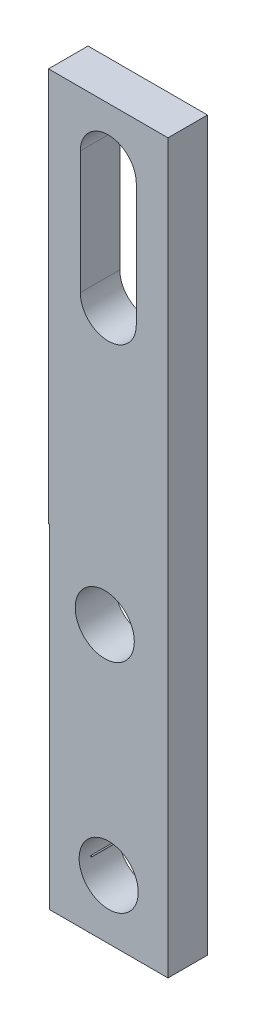
ISO-10303-21;
HEADER;
FILE_DESCRIPTION(('STEP AP214'),'2;1');
FILE_NAME('part.step','',(''),(''),'','','');
FILE_SCHEMA(('AUTOMOTIVE_DESIGN { 1 0 10303 214 1 1 1 1 }'));
ENDSEC;
DATA;
#1=APPLICATION_CONTEXT('core data for automotive mechanical design processes');
#2=APPLICATION_PROTOCOL_DEFINITION('international standard','automotive_design',2000,#1);
#3=PRODUCT_CONTEXT('',#1,'mechanical');
#4=PRODUCT('Part','Part','',(#3));
#5=PRODUCT_RELATED_PRODUCT_CATEGORY('part','',(#4));
#6=PRODUCT_DEFINITION_FORMATION('','',#4);
#7=PRODUCT_DEFINITION_CONTEXT('part definition',#1,'design');
#8=PRODUCT_DEFINITION('design','',#6,#7);
#9=PRODUCT_DEFINITION_SHAPE('','',#8);
#10=(LENGTH_UNIT() NAMED_UNIT(*) SI_UNIT(.MILLI.,.METRE.));
#11=(NAMED_UNIT(*) PLANE_ANGLE_UNIT() SI_UNIT($,.RADIAN.));
#12=(NAMED_UNIT(*) SI_UNIT($,.STERADIAN.) SOLID_ANGLE_UNIT());
#13=UNCERTAINTY_MEASURE_WITH_UNIT(LENGTH_MEASURE(1.E-05),#10,'distance_accuracy_value','');
#14=(GEOMETRIC_REPRESENTATION_CONTEXT(3) GLOBAL_UNCERTAINTY_ASSIGNED_CONTEXT((#13)) GLOBAL_UNIT_ASSIGNED_CONTEXT((#10,
#11,#12)) REPRESENTATION_CONTEXT('',''));
#15=CARTESIAN_POINT('',(0.,0.,0.));
#16=DIRECTION('',(0.,0.,1.));
#17=DIRECTION('',(1.,0.,0.));
#18=AXIS2_PLACEMENT_3D('',#15,#16,#17);
#19=CARTESIAN_POINT('',(0.,-102.917357181781,2.54));
#20=DIRECTION('',(0.,1.,0.));
#21=DIRECTION('',(0.,0.,1.));
#22=AXIS2_PLACEMENT_3D('',#19,#20,#21);
#23=PLANE('',#22);
#24=DIRECTION('',(1.,0.,0.));
#25=VECTOR('',#24,1.);
#26=CARTESIAN_POINT('',(0.,-102.917357181781,0.));
#27=LINE('',#26,#25);
#28=CARTESIAN_POINT('',(-30.7115795856608,-102.917357181781,0.));
#29=VERTEX_POINT('',#28);
#30=CARTESIAN_POINT('',(-23.0915795856608,-102.917357181781,0.));
#31=VERTEX_POINT('',#30);
#32=EDGE_CURVE('E156',#29,#31,#27,.T.);
#33=ORIENTED_EDGE('',*,*,#32,.T.);
#34=DIRECTION('',(0.,0.,-1.));
#35=VECTOR('',#34,1.);
#36=CARTESIAN_POINT('',(-23.0915795856608,-102.917357181781,2.54));
#37=LINE('',#36,#35);
#38=CARTESIAN_POINT('',(-23.0915795856608,-102.917357181781,2.54));
#39=VERTEX_POINT('',#38);
#40=EDGE_CURVE('E160',#39,#31,#37,.T.);
#41=ORIENTED_EDGE('',*,*,#40,.F.);
#42=DIRECTION('',(1.,0.,0.));
#43=VECTOR('',#42,1.);
#44=CARTESIAN_POINT('',(0.,-102.917357181781,2.54));
#45=LINE('',#44,#43);
#46=CARTESIAN_POINT('',(-30.7115795856608,-102.917357181781,2.54));
#47=VERTEX_POINT('',#46);
#48=EDGE_CURVE('E201',#47,#39,#45,.T.);
#49=ORIENTED_EDGE('',*,*,#48,.F.);
#50=DIRECTION('',(0.,0.,-1.));
#51=VECTOR('',#50,1.);
#52=CARTESIAN_POINT('',(-30.7115795856608,-102.917357181781,2.54));
#53=LINE('',#52,#51);
#54=EDGE_CURVE('E177',#47,#29,#53,.T.);
#55=ORIENTED_EDGE('',*,*,#54,.T.);
#56=EDGE_LOOP('',(#33,#41,#49,#55));
#57=FACE_BOUND('',#56,.T.);
#58=ADVANCED_FACE('F44',(#57),#23,.F.);
#59=CARTESIAN_POINT('',(-23.0915795856608,0.,2.54));
#60=DIRECTION('',(-1.,0.,0.));
#61=DIRECTION('',(0.,0.,1.));
#62=AXIS2_PLACEMENT_3D('',#59,#60,#61);
#63=PLANE('',#62);
#64=DIRECTION('',(0.,1.,0.));
#65=VECTOR('',#64,1.);
#66=CARTESIAN_POINT('',(-23.0915795856608,0.,0.));
#67=LINE('',#66,#65);
#68=CARTESIAN_POINT('',(-23.0915795856608,-56.1538406257807,0.));
#69=VERTEX_POINT('',#68);
#70=EDGE_CURVE('E164',#31,#69,#67,.T.);
#71=ORIENTED_EDGE('',*,*,#70,.T.);
#72=DIRECTION('',(0.,0.,-1.));
#73=VECTOR('',#72,1.);
#74=CARTESIAN_POINT('',(-23.0915795856608,-56.1538406257807,2.54));
#75=LINE('',#74,#73);
#76=CARTESIAN_POINT('',(-23.0915795856608,-56.1538406257807,2.54));
#77=VERTEX_POINT('',#76);
#78=EDGE_CURVE('E165',#77,#69,#75,.T.);
#79=ORIENTED_EDGE('',*,*,#78,.F.);
#80=DIRECTION('',(0.,1.,0.));
#81=VECTOR('',#80,1.);
#82=CARTESIAN_POINT('',(-23.0915795856608,0.,2.54));
#83=LINE('',#82,#81);
#84=EDGE_CURVE('E195',#39,#77,#83,.T.);
#85=ORIENTED_EDGE('',*,*,#84,.F.);
#86=ORIENTED_EDGE('',*,*,#40,.T.);
#87=EDGE_LOOP('',(#71,#79,#85,#86));
#88=FACE_BOUND('',#87,.T.);
#89=ADVANCED_FACE('F229',(#88),#63,.F.);
#90=CARTESIAN_POINT('',(0.,-56.1538406257807,2.54));
#91=DIRECTION('',(0.,1.,0.));
#92=DIRECTION('',(0.,0.,1.));
#93=AXIS2_PLACEMENT_3D('',#90,#91,#92);
#94=PLANE('',#93);
#95=DIRECTION('',(1.,0.,0.));
#96=VECTOR('',#95,1.);
#97=CARTESIAN_POINT('',(0.,-56.1538406257807,0.));
#98=LINE('',#97,#96);
#99=CARTESIAN_POINT('',(-30.7701788962918,-56.1538406257807,0.));
#100=VERTEX_POINT('',#99);
#101=EDGE_CURVE('E12',#100,#69,#98,.T.);
#102=ORIENTED_EDGE('',*,*,#101,.F.);
#103=DIRECTION('',(0.,0.,-1.));
#104=VECTOR('',#103,1.);
#105=CARTESIAN_POINT('',(-30.7701788962918,-56.1538406257807,2.54));
#106=LINE('',#105,#104);
#107=CARTESIAN_POINT('',(-30.7701788962918,-56.1538406257807,2.54));
#108=VERTEX_POINT('',#107);
#109=EDGE_CURVE('E168',#108,#100,#106,.T.);
#110=ORIENTED_EDGE('',*,*,#109,.F.);
#111=DIRECTION('',(1.,0.,0.));
#112=VECTOR('',#111,1.);
#113=CARTESIAN_POINT('',(0.,-56.1538406257807,2.54));
#114=LINE('',#113,#112);
#115=EDGE_CURVE('E163',#108,#77,#114,.T.);
#116=ORIENTED_EDGE('',*,*,#115,.T.);
#117=ORIENTED_EDGE('',*,*,#78,.T.);
#118=EDGE_LOOP('',(#102,#110,#116,#117));
#119=FACE_BOUND('',#118,.T.);
#120=ADVANCED_FACE('F235',(#119),#94,.T.);
#121=CARTESIAN_POINT('',(-30.7701788962918,0.,2.54));
#122=DIRECTION('',(-1.,0.,0.));
#123=DIRECTION('',(0.,0.,1.));
#124=AXIS2_PLACEMENT_3D('',#121,#122,#123);
#125=PLANE('',#124);
#126=DIRECTION('',(0.,1.,0.));
#127=VECTOR('',#126,1.);
#128=CARTESIAN_POINT('',(-30.7701788962918,0.,0.));
#129=LINE('',#128,#127);
#130=CARTESIAN_POINT('',(-30.7701788962918,-81.4673571817807,0.));
#131=VERTEX_POINT('',#130);
#132=EDGE_CURVE('E53',#131,#100,#129,.T.);
#133=ORIENTED_EDGE('',*,*,#132,.F.);
#134=DIRECTION('',(0.,0.,-1.));
#135=VECTOR('',#134,1.);
#136=CARTESIAN_POINT('',(-30.7701788962918,-81.4673571817807,2.54));
#137=LINE('',#136,#135);
#138=CARTESIAN_POINT('',(-30.7701788962918,-81.4673571817807,2.54));
#139=VERTEX_POINT('',#138);
#140=EDGE_CURVE('E171',#139,#131,#137,.T.);
#141=ORIENTED_EDGE('',*,*,#140,.F.);
#142=DIRECTION('',(0.,1.,0.));
#143=VECTOR('',#142,1.);
#144=CARTESIAN_POINT('',(-30.7701788962918,0.,2.54));
#145=LINE('',#144,#143);
#146=EDGE_CURVE('E167',#139,#108,#145,.T.);
#147=ORIENTED_EDGE('',*,*,#146,.T.);
#148=ORIENTED_EDGE('',*,*,#109,.T.);
#149=EDGE_LOOP('',(#133,#141,#147,#148));
#150=FACE_BOUND('',#149,.T.);
#151=ADVANCED_FACE('F242',(#150),#125,.T.);
#152=CARTESIAN_POINT('',(0.,-81.4673571817807,2.54));
#153=DIRECTION('',(0.,1.,0.));
#154=DIRECTION('',(0.,0.,1.));
#155=AXIS2_PLACEMENT_3D('',#152,#153,#154);
#156=PLANE('',#155);
#157=DIRECTION('',(1.,0.,0.));
#158=VECTOR('',#157,1.);
#159=CARTESIAN_POINT('',(0.,-81.4673571817807,0.));
#160=LINE('',#159,#158);
#161=CARTESIAN_POINT('',(-30.7115795856608,-81.4673571817807,0.));
#162=VERTEX_POINT('',#161);
#163=EDGE_CURVE('E170',#131,#162,#160,.T.);
#164=ORIENTED_EDGE('',*,*,#163,.T.);
#165=DIRECTION('',(0.,0.,-1.));
#166=VECTOR('',#165,1.);
#167=CARTESIAN_POINT('',(-30.7115795856608,-81.4673571817807,2.54));
#168=LINE('',#167,#166);
#169=CARTESIAN_POINT('',(-30.7115795856608,-81.4673571817807,2.54));
#170=VERTEX_POINT('',#169);
#171=EDGE_CURVE('E174',#170,#162,#168,.T.);
#172=ORIENTED_EDGE('',*,*,#171,.F.);
#173=DIRECTION('',(1.,0.,0.));
#174=VECTOR('',#173,1.);
#175=CARTESIAN_POINT('',(0.,-81.4673571817807,2.54));
#176=LINE('',#175,#174);
#177=EDGE_CURVE('E193',#139,#170,#176,.T.);
#178=ORIENTED_EDGE('',*,*,#177,.F.);
#179=ORIENTED_EDGE('',*,*,#140,.T.);
#180=EDGE_LOOP('',(#164,#172,#178,#179));
#181=FACE_BOUND('',#180,.T.);
#182=ADVANCED_FACE('F246',(#181),#156,.F.);
#183=CARTESIAN_POINT('',(-30.7115795856608,0.,2.54));
#184=DIRECTION('',(-1.,0.,0.));
#185=DIRECTION('',(0.,0.,1.));
#186=AXIS2_PLACEMENT_3D('',#183,#184,#185);
#187=PLANE('',#186);
#188=DIRECTION('',(0.,1.,0.));
#189=VECTOR('',#188,1.);
#190=CARTESIAN_POINT('',(-30.7115795856608,0.,0.));
#191=LINE('',#190,#189);
#192=EDGE_CURVE('E179',#29,#162,#191,.T.);
#193=ORIENTED_EDGE('',*,*,#192,.F.);
#194=ORIENTED_EDGE('',*,*,#54,.F.);
#195=DIRECTION('',(0.,1.,0.));
#196=VECTOR('',#195,1.);
#197=CARTESIAN_POINT('',(-30.7115795856608,0.,2.54));
#198=LINE('',#197,#196);
#199=EDGE_CURVE('E173',#47,#170,#198,.T.);
#200=ORIENTED_EDGE('',*,*,#199,.T.);
#201=ORIENTED_EDGE('',*,*,#171,.T.);
#202=EDGE_LOOP('',(#193,#194,#200,#201));
#203=FACE_BOUND('',#202,.T.);
#204=ADVANCED_FACE('F250',(#203),#187,.T.);
#205=CARTESIAN_POINT('',(0.,0.,2.54));
#206=DIRECTION('',(0.,0.,1.));
#207=DIRECTION('',(1.,0.,0.));
#208=AXIS2_PLACEMENT_3D('',#205,#206,#207);
#209=PLANE('',#208);
#210=CARTESIAN_POINT('',(-26.9286527870987,-59.7073572677807,2.54));
#211=DIRECTION('',(0.,0.,1.));
#212=DIRECTION('',(-1.,0.,0.));
#213=AXIS2_PLACEMENT_3D('',#210,#211,#212);
#214=CIRCLE('',#213,1.799999956);
#215=CARTESIAN_POINT('',(-25.1286528310987,-59.7073572677807,2.54));
#216=VERTEX_POINT('',#215);
#217=CARTESIAN_POINT('',(-28.7286527430987,-59.7073572677807,2.54));
#218=VERTEX_POINT('',#217);
#219=EDGE_CURVE('E61',#216,#218,#214,.T.);
#220=ORIENTED_EDGE('',*,*,#219,.F.);
#221=DIRECTION('',(0.,1.,0.));
#222=VECTOR('',#221,1.);
#223=CARTESIAN_POINT('',(-25.1286528310987,-59.7073572677807,2.54));
#224=LINE('',#223,#222);
#225=CARTESIAN_POINT('',(-25.1286528310987,-67.588775762085,2.54));
#226=VERTEX_POINT('',#225);
#227=EDGE_CURVE('E141',#226,#216,#224,.T.);
#228=ORIENTED_EDGE('',*,*,#227,.F.);
#229=CARTESIAN_POINT('',(-26.9286527870987,-67.588775762085,2.54));
#230=DIRECTION('',(0.,0.,1.));
#231=DIRECTION('',(1.,0.,0.));
#232=AXIS2_PLACEMENT_3D('',#229,#230,#231);
#233=CIRCLE('',#232,1.799999956);
#234=CARTESIAN_POINT('',(-28.7286527430987,-67.588775762085,2.54));
#235=VERTEX_POINT('',#234);
#236=EDGE_CURVE('E144',#235,#226,#233,.T.);
#237=ORIENTED_EDGE('',*,*,#236,.F.);
#238=DIRECTION('',(0.,-1.,0.));
#239=VECTOR('',#238,1.);
#240=CARTESIAN_POINT('',(-28.7286527430987,-59.7073572677807,2.54));
#241=LINE('',#240,#239);
#242=EDGE_CURVE('E150',#218,#235,#241,.T.);
#243=ORIENTED_EDGE('',*,*,#242,.F.);
#244=EDGE_LOOP('',(#220,#228,#237,#243));
#245=FACE_BOUND('',#244,.T.);
#246=CARTESIAN_POINT('',(-26.9015795856608,-99.1073571817807,2.54));
#247=DIRECTION('',(0.,0.,1.));
#248=DIRECTION('',(1.,0.,0.));
#249=AXIS2_PLACEMENT_3D('',#246,#247,#248);
#250=CIRCLE('',#249,1.89865);
#251=CARTESIAN_POINT('',(-25.0029295856608,-99.1073571817807,2.54));
#252=VERTEX_POINT('',#251);
#253=EDGE_CURVE('E176',#252,#252,#250,.F.);
#254=ORIENTED_EDGE('',*,*,#253,.T.);
#255=EDGE_LOOP('',(#254));
#256=FACE_BOUND('',#255,.T.);
#257=CARTESIAN_POINT('',(-27.154806567225,-85.2773571817807,2.54));
#258=DIRECTION('',(0.,0.,1.));
#259=DIRECTION('',(1.,0.,0.));
#260=AXIS2_PLACEMENT_3D('',#257,#258,#259);
#261=CIRCLE('',#260,1.89865);
#262=CARTESIAN_POINT('',(-25.256156567225,-85.2773571817807,2.54));
#263=VERTEX_POINT('',#262);
#264=EDGE_CURVE('E204',#263,#263,#261,.F.);
#265=ORIENTED_EDGE('',*,*,#264,.T.);
#266=EDGE_LOOP('',(#265));
#267=FACE_BOUND('',#266,.T.);
#268=ORIENTED_EDGE('',*,*,#48,.T.);
#269=ORIENTED_EDGE('',*,*,#84,.T.);
#270=ORIENTED_EDGE('',*,*,#115,.F.);
#271=ORIENTED_EDGE('',*,*,#146,.F.);
#272=ORIENTED_EDGE('',*,*,#177,.T.);
#273=ORIENTED_EDGE('',*,*,#199,.F.);
#274=EDGE_LOOP('',(#268,#269,#270,#271,#272,#273));
#275=FACE_BOUND('',#274,.T.);
#276=ADVANCED_FACE('F46',(#245,#256,#267,#275),#209,.T.);
#277=CARTESIAN_POINT('',(0.,0.,0.));
#278=DIRECTION('',(0.,0.,1.));
#279=DIRECTION('',(1.,0.,0.));
#280=AXIS2_PLACEMENT_3D('',#277,#278,#279);
#281=PLANE('',#280);
#282=DIRECTION('',(0.,1.,0.));
#283=VECTOR('',#282,1.);
#284=CARTESIAN_POINT('',(-25.1286528310987,-59.7073572677807,0.));
#285=LINE('',#284,#283);
#286=CARTESIAN_POINT('',(-25.1286528310987,-67.588775762085,0.));
#287=VERTEX_POINT('',#286);
#288=CARTESIAN_POINT('',(-25.1286528310987,-59.7073572677807,0.));
#289=VERTEX_POINT('',#288);
#290=EDGE_CURVE('E131',#287,#289,#285,.T.);
#291=ORIENTED_EDGE('',*,*,#290,.T.);
#292=CARTESIAN_POINT('',(-26.9286527870987,-59.7073572677807,0.));
#293=DIRECTION('',(0.,0.,1.));
#294=DIRECTION('',(-1.,0.,0.));
#295=AXIS2_PLACEMENT_3D('',#292,#293,#294);
#296=CIRCLE('',#295,1.799999956);
#297=CARTESIAN_POINT('',(-28.7286527430987,-59.7073572677807,0.));
#298=VERTEX_POINT('',#297);
#299=EDGE_CURVE('E125',#289,#298,#296,.T.);
#300=ORIENTED_EDGE('',*,*,#299,.T.);
#301=DIRECTION('',(0.,-1.,0.));
#302=VECTOR('',#301,1.);
#303=CARTESIAN_POINT('',(-28.7286527430987,-59.7073572677807,0.));
#304=LINE('',#303,#302);
#305=CARTESIAN_POINT('',(-28.7286527430987,-67.588775762085,0.));
#306=VERTEX_POINT('',#305);
#307=EDGE_CURVE('E134',#298,#306,#304,.T.);
#308=ORIENTED_EDGE('',*,*,#307,.T.);
#309=CARTESIAN_POINT('',(-26.9286527870987,-67.588775762085,0.));
#310=DIRECTION('',(0.,0.,1.));
#311=DIRECTION('',(1.,0.,0.));
#312=AXIS2_PLACEMENT_3D('',#309,#310,#311);
#313=CIRCLE('',#312,1.799999956);
#314=EDGE_CURVE('E69',#306,#287,#313,.T.);
#315=ORIENTED_EDGE('',*,*,#314,.T.);
#316=EDGE_LOOP('',(#291,#300,#308,#315));
#317=FACE_BOUND('',#316,.T.);
#318=CARTESIAN_POINT('',(-26.9015795856608,-99.1073571817807,0.));
#319=DIRECTION('',(0.,0.,1.));
#320=DIRECTION('',(1.,0.,0.));
#321=AXIS2_PLACEMENT_3D('',#318,#319,#320);
#322=CIRCLE('',#321,1.89865);
#323=CARTESIAN_POINT('',(-25.0029295856608,-99.1073571817807,0.));
#324=VERTEX_POINT('',#323);
#325=EDGE_CURVE('E48',#324,#324,#322,.T.);
#326=ORIENTED_EDGE('',*,*,#325,.T.);
#327=EDGE_LOOP('',(#326));
#328=FACE_BOUND('',#327,.T.);
#329=CARTESIAN_POINT('',(-27.154806567225,-85.2773571817807,0.));
#330=DIRECTION('',(0.,0.,1.));
#331=DIRECTION('',(1.,0.,0.));
#332=AXIS2_PLACEMENT_3D('',#329,#330,#331);
#333=CIRCLE('',#332,1.89865);
#334=CARTESIAN_POINT('',(-25.256156567225,-85.2773571817807,0.));
#335=VERTEX_POINT('',#334);
#336=EDGE_CURVE('E182',#335,#335,#333,.T.);
#337=ORIENTED_EDGE('',*,*,#336,.T.);
#338=EDGE_LOOP('',(#337));
#339=FACE_BOUND('',#338,.T.);
#340=ORIENTED_EDGE('',*,*,#32,.F.);
#341=ORIENTED_EDGE('',*,*,#192,.T.);
#342=ORIENTED_EDGE('',*,*,#163,.F.);
#343=ORIENTED_EDGE('',*,*,#132,.T.);
#344=ORIENTED_EDGE('',*,*,#101,.T.);
#345=ORIENTED_EDGE('',*,*,#70,.F.);
#346=EDGE_LOOP('',(#340,#341,#342,#343,#344,#345));
#347=FACE_BOUND('',#346,.T.);
#348=ADVANCED_FACE('F138',(#317,#328,#339,#347),#281,.F.);
#349=CARTESIAN_POINT('',(-27.154806567225,-85.2773571817807,4.572));
#350=DIRECTION('',(0.,0.,-1.));
#351=DIRECTION('',(-1.,0.,0.));
#352=AXIS2_PLACEMENT_3D('',#349,#350,#351);
#353=CYLINDRICAL_SURFACE('',#352,1.89865);
#354=ORIENTED_EDGE('',*,*,#264,.F.);
#355=EDGE_LOOP('',(#354));
#356=FACE_BOUND('',#355,.T.);
#357=ORIENTED_EDGE('',*,*,#336,.F.);
#358=EDGE_LOOP('',(#357));
#359=FACE_BOUND('',#358,.T.);
#360=ADVANCED_FACE('F216',(#356,#359),#353,.F.);
#361=CARTESIAN_POINT('',(-26.9015795856608,-99.1073571817807,4.572));
#362=DIRECTION('',(0.,0.,-1.));
#363=DIRECTION('',(-1.,0.,0.));
#364=AXIS2_PLACEMENT_3D('',#361,#362,#363);
#365=CYLINDRICAL_SURFACE('',#364,1.89865);
#366=ORIENTED_EDGE('',*,*,#253,.F.);
#367=EDGE_LOOP('',(#366));
#368=FACE_BOUND('',#367,.T.);
#369=ORIENTED_EDGE('',*,*,#325,.F.);
#370=EDGE_LOOP('',(#369));
#371=FACE_BOUND('',#370,.T.);
#372=ADVANCED_FACE('F214',(#368,#371),#365,.F.);
#373=CARTESIAN_POINT('',(-26.9286527870987,-59.7073572677807,0.));
#374=DIRECTION('',(0.,0.,1.));
#375=DIRECTION('',(1.,0.,0.));
#376=AXIS2_PLACEMENT_3D('',#373,#374,#375);
#377=CYLINDRICAL_SURFACE('',#376,1.799999956);
#378=ORIENTED_EDGE('',*,*,#219,.T.);
#379=DIRECTION('',(0.,0.,1.));
#380=VECTOR('',#379,1.);
#381=CARTESIAN_POINT('',(-28.7286527430987,-59.7073572677807,0.));
#382=LINE('',#381,#380);
#383=EDGE_CURVE('E121',#298,#218,#382,.T.);
#384=ORIENTED_EDGE('',*,*,#383,.F.);
#385=ORIENTED_EDGE('',*,*,#299,.F.);
#386=DIRECTION('',(0.,0.,1.));
#387=VECTOR('',#386,1.);
#388=CARTESIAN_POINT('',(-25.1286528310987,-59.7073572677807,0.));
#389=LINE('',#388,#387);
#390=EDGE_CURVE('E154',#289,#216,#389,.T.);
#391=ORIENTED_EDGE('',*,*,#390,.T.);
#392=EDGE_LOOP('',(#378,#384,#385,#391));
#393=FACE_BOUND('',#392,.T.);
#394=ADVANCED_FACE('F123',(#393),#377,.F.);
#395=CARTESIAN_POINT('',(-25.1286528310987,-59.7073572677807,0.));
#396=DIRECTION('',(1.,0.,0.));
#397=DIRECTION('',(0.,0.,-1.));
#398=AXIS2_PLACEMENT_3D('',#395,#396,#397);
#399=PLANE('',#398);
#400=ORIENTED_EDGE('',*,*,#227,.T.);
#401=ORIENTED_EDGE('',*,*,#390,.F.);
#402=ORIENTED_EDGE('',*,*,#290,.F.);
#403=DIRECTION('',(0.,0.,1.));
#404=VECTOR('',#403,1.);
#405=CARTESIAN_POINT('',(-25.1286528310987,-67.588775762085,0.));
#406=LINE('',#405,#404);
#407=EDGE_CURVE('E157',#287,#226,#406,.T.);
#408=ORIENTED_EDGE('',*,*,#407,.T.);
#409=EDGE_LOOP('',(#400,#401,#402,#408));
#410=FACE_BOUND('',#409,.T.);
#411=ADVANCED_FACE('F223',(#410),#399,.F.);
#412=CARTESIAN_POINT('',(-26.9286527870987,-67.588775762085,0.));
#413=DIRECTION('',(0.,0.,1.));
#414=DIRECTION('',(1.,0.,0.));
#415=AXIS2_PLACEMENT_3D('',#412,#413,#414);
#416=CYLINDRICAL_SURFACE('',#415,1.799999956);
#417=ORIENTED_EDGE('',*,*,#236,.T.);
#418=ORIENTED_EDGE('',*,*,#407,.F.);
#419=ORIENTED_EDGE('',*,*,#314,.F.);
#420=DIRECTION('',(0.,0.,1.));
#421=VECTOR('',#420,1.);
#422=CARTESIAN_POINT('',(-28.7286527430987,-67.588775762085,0.));
#423=LINE('',#422,#421);
#424=EDGE_CURVE('E130',#306,#235,#423,.T.);
#425=ORIENTED_EDGE('',*,*,#424,.T.);
#426=EDGE_LOOP('',(#417,#418,#419,#425));
#427=FACE_BOUND('',#426,.T.);
#428=ADVANCED_FACE('F357',(#427),#416,.F.);
#429=CARTESIAN_POINT('',(-28.7286527430987,-59.7073572677807,0.));
#430=DIRECTION('',(-1.,0.,0.));
#431=DIRECTION('',(0.,0.,1.));
#432=AXIS2_PLACEMENT_3D('',#429,#430,#431);
#433=PLANE('',#432);
#434=ORIENTED_EDGE('',*,*,#242,.T.);
#435=ORIENTED_EDGE('',*,*,#424,.F.);
#436=ORIENTED_EDGE('',*,*,#307,.F.);
#437=ORIENTED_EDGE('',*,*,#383,.T.);
#438=EDGE_LOOP('',(#434,#435,#436,#437));
#439=FACE_BOUND('',#438,.T.);
#440=ADVANCED_FACE('F135',(#439),#433,.F.);
#441=CLOSED_SHELL('',(#58,#89,#120,#151,#182,#204,#276,#348,#360,#372,#394,#411,#428,#440));
#442=MANIFOLD_SOLID_BREP('B2',#441);
#443=CARTESIAN_POINT('',(0.,0.,0.));
#444=DIRECTION('',(0.,0.,1.));
#445=DIRECTION('',(1.,0.,0.));
#446=AXIS2_PLACEMENT_3D('',#443,#444,#445);
#447=PLANE('',#446);
#448=CARTESIAN_POINT('',(-28.0322670401761,-98.6168628480288,0.));
#449=DIRECTION('',(0.,0.,1.));
#450=DIRECTION('',(1.,0.,0.));
#451=AXIS2_PLACEMENT_3D('',#448,#449,#450);
#452=CIRCLE('',#451,0.039656003830893);
#453=CARTESIAN_POINT('',(-27.9926110363452,-98.6168628480288,0.));
#454=VERTEX_POINT('',#453);
#455=EDGE_CURVE('E391',#454,#454,#452,.T.);
#456=ORIENTED_EDGE('',*,*,#455,.F.);
#457=EDGE_LOOP('',(#456));
#458=FACE_BOUND('',#457,.T.);
#459=ADVANCED_FACE('F385',(#458),#447,.F.);
#460=CARTESIAN_POINT('',(-28.0322670401761,-98.6168628480288,4.572));
#461=DIRECTION('',(0.,0.,-1.));
#462=DIRECTION('',(-1.,0.,0.));
#463=AXIS2_PLACEMENT_3D('',#460,#461,#462);
#464=CYLINDRICAL_SURFACE('',#463,0.039656003830893);
#465=CARTESIAN_POINT('',(-28.0322670401761,-98.6168628480288,2.54));
#466=DIRECTION('',(0.,0.,1.));
#467=DIRECTION('',(1.,0.,0.));
#468=AXIS2_PLACEMENT_3D('',#465,#466,#467);
#469=CIRCLE('',#468,0.039656003830893);
#470=CARTESIAN_POINT('',(-27.9926110363452,-98.6168628480288,2.54));
#471=VERTEX_POINT('',#470);
#472=EDGE_CURVE('E43',#471,#471,#469,.F.);
#473=ORIENTED_EDGE('',*,*,#472,.T.);
#474=EDGE_LOOP('',(#473));
#475=FACE_BOUND('',#474,.T.);
#476=ORIENTED_EDGE('',*,*,#455,.T.);
#477=EDGE_LOOP('',(#476));
#478=FACE_BOUND('',#477,.T.);
#479=ADVANCED_FACE('F397',(#475,#478),#464,.T.);
#480=CARTESIAN_POINT('',(0.,0.,2.54));
#481=DIRECTION('',(0.,0.,1.));
#482=DIRECTION('',(1.,0.,0.));
#483=AXIS2_PLACEMENT_3D('',#480,#481,#482);
#484=PLANE('',#483);
#485=ORIENTED_EDGE('',*,*,#472,.F.);
#486=EDGE_LOOP('',(#485));
#487=FACE_BOUND('',#486,.T.);
#488=ADVANCED_FACE('F403',(#487),#484,.T.);
#489=CLOSED_SHELL('',(#459,#479,#488));
#490=MANIFOLD_SOLID_BREP('B6',#489);
#491=ADVANCED_BREP_SHAPE_REPRESENTATION('',(#18,#442,#490),#14);
#492=SHAPE_DEFINITION_REPRESENTATION(#9,#491);
ENDSEC;
END-ISO-10303-21;
